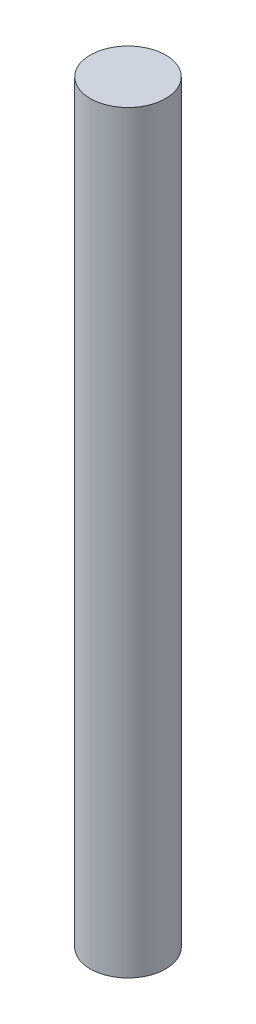
ISO-10303-21;
HEADER;
FILE_DESCRIPTION(('STEP AP214'),'2;1');
FILE_NAME('part.step','',(''),(''),'','','');
FILE_SCHEMA(('AUTOMOTIVE_DESIGN { 1 0 10303 214 1 1 1 1 }'));
ENDSEC;
DATA;
#1=APPLICATION_CONTEXT('core data for automotive mechanical design processes');
#2=APPLICATION_PROTOCOL_DEFINITION('international standard','automotive_design',2000,#1);
#3=PRODUCT_CONTEXT('',#1,'mechanical');
#4=PRODUCT('Part','Part','',(#3));
#5=PRODUCT_RELATED_PRODUCT_CATEGORY('part','',(#4));
#6=PRODUCT_DEFINITION_FORMATION('','',#4);
#7=PRODUCT_DEFINITION_CONTEXT('part definition',#1,'design');
#8=PRODUCT_DEFINITION('design','',#6,#7);
#9=PRODUCT_DEFINITION_SHAPE('','',#8);
#10=(LENGTH_UNIT() NAMED_UNIT(*) SI_UNIT(.MILLI.,.METRE.));
#11=(NAMED_UNIT(*) PLANE_ANGLE_UNIT() SI_UNIT($,.RADIAN.));
#12=(NAMED_UNIT(*) SI_UNIT($,.STERADIAN.) SOLID_ANGLE_UNIT());
#13=UNCERTAINTY_MEASURE_WITH_UNIT(LENGTH_MEASURE(1.E-05),#10,'distance_accuracy_value','');
#14=(GEOMETRIC_REPRESENTATION_CONTEXT(3) GLOBAL_UNCERTAINTY_ASSIGNED_CONTEXT((#13)) GLOBAL_UNIT_ASSIGNED_CONTEXT((#10,
#11,#12)) REPRESENTATION_CONTEXT('',''));
#15=CARTESIAN_POINT('',(0.,0.,0.));
#16=DIRECTION('',(0.,0.,1.));
#17=DIRECTION('',(1.,0.,0.));
#18=AXIS2_PLACEMENT_3D('',#15,#16,#17);
#19=CARTESIAN_POINT('',(0.,15.,0.));
#20=DIRECTION('',(0.,-1.,0.));
#21=DIRECTION('',(0.,0.,-1.));
#22=AXIS2_PLACEMENT_3D('',#19,#20,#21);
#23=CYLINDRICAL_SURFACE('',#22,0.750000000000001);
#24=CARTESIAN_POINT('',(0.,15.,0.));
#25=DIRECTION('',(0.,1.,0.));
#26=DIRECTION('',(0.,0.,1.));
#27=AXIS2_PLACEMENT_3D('',#24,#25,#26);
#28=CIRCLE('',#27,0.750000000000001);
#29=CARTESIAN_POINT('',(0.,15.,0.750000000000001));
#30=VERTEX_POINT('',#29);
#31=EDGE_CURVE('E10',#30,#30,#28,.T.);
#32=ORIENTED_EDGE('',*,*,#31,.F.);
#33=EDGE_LOOP('',(#32));
#34=FACE_BOUND('',#33,.T.);
#35=CARTESIAN_POINT('',(0.,0.,0.));
#36=DIRECTION('',(0.,1.,0.));
#37=DIRECTION('',(0.,0.,1.));
#38=AXIS2_PLACEMENT_3D('',#35,#36,#37);
#39=CIRCLE('',#38,0.750000000000001);
#40=CARTESIAN_POINT('',(0.,0.,0.750000000000001));
#41=VERTEX_POINT('',#40);
#42=EDGE_CURVE('E34',#41,#41,#39,.T.);
#43=ORIENTED_EDGE('',*,*,#42,.T.);
#44=EDGE_LOOP('',(#43));
#45=FACE_BOUND('',#44,.T.);
#46=ADVANCED_FACE('F31',(#34,#45),#23,.T.);
#47=CARTESIAN_POINT('',(0.,15.,0.));
#48=DIRECTION('',(0.,1.,0.));
#49=DIRECTION('',(0.,0.,1.));
#50=AXIS2_PLACEMENT_3D('',#47,#48,#49);
#51=PLANE('',#50);
#52=ORIENTED_EDGE('',*,*,#31,.T.);
#53=EDGE_LOOP('',(#52));
#54=FACE_BOUND('',#53,.T.);
#55=ADVANCED_FACE('F46',(#54),#51,.T.);
#56=CARTESIAN_POINT('',(0.,0.,0.));
#57=DIRECTION('',(0.,1.,0.));
#58=DIRECTION('',(0.,0.,1.));
#59=AXIS2_PLACEMENT_3D('',#56,#57,#58);
#60=PLANE('',#59);
#61=ORIENTED_EDGE('',*,*,#42,.F.);
#62=EDGE_LOOP('',(#61));
#63=FACE_BOUND('',#62,.T.);
#64=ADVANCED_FACE('F44',(#63),#60,.F.);
#65=CLOSED_SHELL('',(#46,#55,#64));
#66=MANIFOLD_SOLID_BREP('B2',#65);
#67=ADVANCED_BREP_SHAPE_REPRESENTATION('',(#18,#66),#14);
#68=SHAPE_DEFINITION_REPRESENTATION(#9,#67);
ENDSEC;
END-ISO-10303-21;
